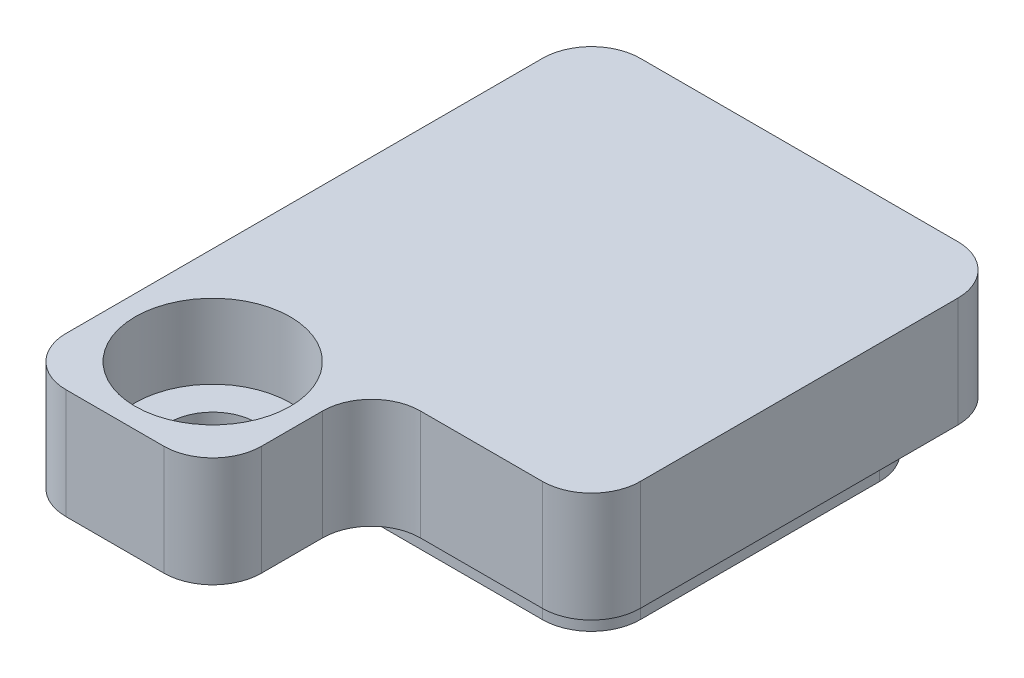
ISO-10303-21;
HEADER;
FILE_DESCRIPTION(('STEP AP214'),'2;1');
FILE_NAME('part.step','',(''),(''),'','','');
FILE_SCHEMA(('AUTOMOTIVE_DESIGN { 1 0 10303 214 1 1 1 1 }'));
ENDSEC;
DATA;
#1=APPLICATION_CONTEXT('core data for automotive mechanical design processes');
#2=APPLICATION_PROTOCOL_DEFINITION('international standard','automotive_design',2000,#1);
#3=PRODUCT_CONTEXT('',#1,'mechanical');
#4=PRODUCT('Part','Part','',(#3));
#5=PRODUCT_RELATED_PRODUCT_CATEGORY('part','',(#4));
#6=PRODUCT_DEFINITION_FORMATION('','',#4);
#7=PRODUCT_DEFINITION_CONTEXT('part definition',#1,'design');
#8=PRODUCT_DEFINITION('design','',#6,#7);
#9=PRODUCT_DEFINITION_SHAPE('','',#8);
#10=(LENGTH_UNIT() NAMED_UNIT(*) SI_UNIT(.MILLI.,.METRE.));
#11=(NAMED_UNIT(*) PLANE_ANGLE_UNIT() SI_UNIT($,.RADIAN.));
#12=(NAMED_UNIT(*) SI_UNIT($,.STERADIAN.) SOLID_ANGLE_UNIT());
#13=UNCERTAINTY_MEASURE_WITH_UNIT(LENGTH_MEASURE(1.E-05),#10,'distance_accuracy_value','');
#14=(GEOMETRIC_REPRESENTATION_CONTEXT(3) GLOBAL_UNCERTAINTY_ASSIGNED_CONTEXT((#13)) GLOBAL_UNIT_ASSIGNED_CONTEXT((#10,
#11,#12)) REPRESENTATION_CONTEXT('',''));
#15=CARTESIAN_POINT('',(0.,0.,0.));
#16=DIRECTION('',(0.,0.,1.));
#17=DIRECTION('',(1.,0.,0.));
#18=AXIS2_PLACEMENT_3D('',#15,#16,#17);
#19=CARTESIAN_POINT('',(-4.25,2.25,4.25));
#20=DIRECTION('',(0.,0.,-1.));
#21=DIRECTION('',(-1.,0.,0.));
#22=AXIS2_PLACEMENT_3D('',#19,#20,#21);
#23=PLANE('',#22);
#24=DIRECTION('',(1.,0.,0.));
#25=VECTOR('',#24,1.);
#26=CARTESIAN_POINT('',(-4.25,0.,4.25));
#27=LINE('',#26,#25);
#28=CARTESIAN_POINT('',(0.749999999999998,0.,4.25));
#29=VERTEX_POINT('',#28);
#30=CARTESIAN_POINT('',(3.25,0.,4.25));
#31=VERTEX_POINT('',#30);
#32=EDGE_CURVE('E209',#29,#31,#27,.T.);
#33=ORIENTED_EDGE('',*,*,#32,.T.);
#34=DIRECTION('',(0.,-1.,0.));
#35=VECTOR('',#34,1.);
#36=CARTESIAN_POINT('',(3.25,2.25,4.25));
#37=LINE('',#36,#35);
#38=CARTESIAN_POINT('',(3.25,2.25,4.25));
#39=VERTEX_POINT('',#38);
#40=EDGE_CURVE('E46',#31,#39,#37,.F.);
#41=ORIENTED_EDGE('',*,*,#40,.T.);
#42=DIRECTION('',(1.,0.,0.));
#43=VECTOR('',#42,1.);
#44=CARTESIAN_POINT('',(-4.25,2.25,4.25));
#45=LINE('',#44,#43);
#46=CARTESIAN_POINT('',(0.749999999999997,2.25,4.25));
#47=VERTEX_POINT('',#46);
#48=EDGE_CURVE('E215',#47,#39,#45,.T.);
#49=ORIENTED_EDGE('',*,*,#48,.F.);
#50=DIRECTION('',(0.,1.,0.));
#51=VECTOR('',#50,1.);
#52=CARTESIAN_POINT('',(0.749999999999998,0.,4.25));
#53=LINE('',#52,#51);
#54=EDGE_CURVE('E252',#47,#29,#53,.F.);
#55=ORIENTED_EDGE('',*,*,#54,.T.);
#56=EDGE_LOOP('',(#33,#41,#49,#55));
#57=FACE_BOUND('',#56,.T.);
#58=ADVANCED_FACE('F31',(#57),#23,.F.);
#59=CARTESIAN_POINT('',(4.25,0.,-4.25));
#60=DIRECTION('',(0.,-1.,0.));
#61=DIRECTION('',(0.,0.,-1.));
#62=AXIS2_PLACEMENT_3D('',#59,#60,#61);
#63=PLANE('',#62);
#64=CARTESIAN_POINT('',(-2.25,0.,5.5));
#65=DIRECTION('',(0.,-1.,0.));
#66=DIRECTION('',(0.,0.,-1.));
#67=AXIS2_PLACEMENT_3D('',#64,#65,#66);
#68=CIRCLE('',#67,0.888999999999999);
#69=CARTESIAN_POINT('',(-2.25,0.,4.611));
#70=VERTEX_POINT('',#69);
#71=EDGE_CURVE('E312',#70,#70,#68,.T.);
#72=ORIENTED_EDGE('',*,*,#71,.F.);
#73=EDGE_LOOP('',(#72));
#74=FACE_BOUND('',#73,.T.);
#75=DIRECTION('',(0.,0.,1.));
#76=VECTOR('',#75,1.);
#77=CARTESIAN_POINT('',(-4.25,0.,4.25));
#78=LINE('',#77,#76);
#79=CARTESIAN_POINT('',(-4.25,0.,-3.25));
#80=VERTEX_POINT('',#79);
#81=CARTESIAN_POINT('',(-4.25,0.,6.5));
#82=VERTEX_POINT('',#81);
#83=EDGE_CURVE('E304',#80,#82,#78,.T.);
#84=ORIENTED_EDGE('',*,*,#83,.F.);
#85=CARTESIAN_POINT('',(-3.25,0.,-3.25));
#86=DIRECTION('',(0.,-1.,0.));
#87=DIRECTION('',(0.,0.,-1.));
#88=AXIS2_PLACEMENT_3D('',#85,#86,#87);
#89=CIRCLE('',#88,1.);
#90=CARTESIAN_POINT('',(-3.25,0.,-4.25));
#91=VERTEX_POINT('',#90);
#92=EDGE_CURVE('E442',#80,#91,#89,.T.);
#93=ORIENTED_EDGE('',*,*,#92,.T.);
#94=DIRECTION('',(-1.,0.,0.));
#95=VECTOR('',#94,1.);
#96=CARTESIAN_POINT('',(-4.25,0.,-4.25));
#97=LINE('',#96,#95);
#98=CARTESIAN_POINT('',(3.25,0.,-4.25));
#99=VERTEX_POINT('',#98);
#100=EDGE_CURVE('E337',#99,#91,#97,.T.);
#101=ORIENTED_EDGE('',*,*,#100,.F.);
#102=CARTESIAN_POINT('',(3.25,0.,-3.25));
#103=DIRECTION('',(0.,-1.,0.));
#104=DIRECTION('',(0.,0.,-1.));
#105=AXIS2_PLACEMENT_3D('',#102,#103,#104);
#106=CIRCLE('',#105,1.);
#107=CARTESIAN_POINT('',(4.25,0.,-3.25));
#108=VERTEX_POINT('',#107);
#109=EDGE_CURVE('E440',#99,#108,#106,.T.);
#110=ORIENTED_EDGE('',*,*,#109,.T.);
#111=DIRECTION('',(0.,0.,-1.));
#112=VECTOR('',#111,1.);
#113=CARTESIAN_POINT('',(4.25,0.,4.25));
#114=LINE('',#113,#112);
#115=CARTESIAN_POINT('',(4.25,0.,3.25));
#116=VERTEX_POINT('',#115);
#117=EDGE_CURVE('E218',#116,#108,#114,.T.);
#118=ORIENTED_EDGE('',*,*,#117,.F.);
#119=CARTESIAN_POINT('',(3.25,0.,3.25));
#120=DIRECTION('',(0.,-1.,0.));
#121=DIRECTION('',(0.,0.,-1.));
#122=AXIS2_PLACEMENT_3D('',#119,#120,#121);
#123=CIRCLE('',#122,1.);
#124=EDGE_CURVE('E436',#116,#31,#123,.T.);
#125=ORIENTED_EDGE('',*,*,#124,.T.);
#126=ORIENTED_EDGE('',*,*,#32,.F.);
#127=CARTESIAN_POINT('',(0.749999999999998,0.,5.25));
#128=DIRECTION('',(0.,-1.,0.));
#129=DIRECTION('',(0.,0.,-1.));
#130=AXIS2_PLACEMENT_3D('',#127,#128,#129);
#131=CIRCLE('',#130,1.);
#132=CARTESIAN_POINT('',(-0.250000000000002,0.,5.25));
#133=VERTEX_POINT('',#132);
#134=EDGE_CURVE('E11',#29,#133,#131,.F.);
#135=ORIENTED_EDGE('',*,*,#134,.T.);
#136=DIRECTION('',(0.,0.,-1.));
#137=VECTOR('',#136,1.);
#138=CARTESIAN_POINT('',(-0.250000000000002,0.,7.5));
#139=LINE('',#138,#137);
#140=CARTESIAN_POINT('',(-0.250000000000002,0.,6.5));
#141=VERTEX_POINT('',#140);
#142=EDGE_CURVE('E278',#141,#133,#139,.T.);
#143=ORIENTED_EDGE('',*,*,#142,.F.);
#144=CARTESIAN_POINT('',(-1.25,0.,6.5));
#145=DIRECTION('',(0.,-1.,0.));
#146=DIRECTION('',(0.,0.,-1.));
#147=AXIS2_PLACEMENT_3D('',#144,#145,#146);
#148=CIRCLE('',#147,1.);
#149=CARTESIAN_POINT('',(-1.25,0.,7.5));
#150=VERTEX_POINT('',#149);
#151=EDGE_CURVE('E301',#141,#150,#148,.T.);
#152=ORIENTED_EDGE('',*,*,#151,.T.);
#153=DIRECTION('',(1.,0.,0.));
#154=VECTOR('',#153,1.);
#155=CARTESIAN_POINT('',(-4.25,0.,7.5));
#156=LINE('',#155,#154);
#157=CARTESIAN_POINT('',(-3.25,0.,7.5));
#158=VERTEX_POINT('',#157);
#159=EDGE_CURVE('E315',#158,#150,#156,.T.);
#160=ORIENTED_EDGE('',*,*,#159,.F.);
#161=CARTESIAN_POINT('',(-3.25,0.,6.5));
#162=DIRECTION('',(0.,-1.,0.));
#163=DIRECTION('',(0.,0.,-1.));
#164=AXIS2_PLACEMENT_3D('',#161,#162,#163);
#165=CIRCLE('',#164,1.);
#166=EDGE_CURVE('E358',#158,#82,#165,.T.);
#167=ORIENTED_EDGE('',*,*,#166,.T.);
#168=EDGE_LOOP('',(#84,#93,#101,#110,#118,#125,#126,#135,#143,#152,#160,#167));
#169=FACE_BOUND('',#168,.T.);
#170=DIRECTION('',(-1.,0.,0.));
#171=VECTOR('',#170,1.);
#172=CARTESIAN_POINT('',(-3.45,0.,3.45));
#173=LINE('',#172,#171);
#174=CARTESIAN_POINT('',(2.45,0.,3.45));
#175=VERTEX_POINT('',#174);
#176=CARTESIAN_POINT('',(-2.45,0.,3.45));
#177=VERTEX_POINT('',#176);
#178=EDGE_CURVE('E201',#175,#177,#173,.T.);
#179=ORIENTED_EDGE('',*,*,#178,.F.);
#180=CARTESIAN_POINT('',(2.45,0.,2.45));
#181=DIRECTION('',(0.,-1.,0.));
#182=DIRECTION('',(0.,0.,-1.));
#183=AXIS2_PLACEMENT_3D('',#180,#181,#182);
#184=CIRCLE('',#183,1.);
#185=CARTESIAN_POINT('',(3.45,0.,2.45));
#186=VERTEX_POINT('',#185);
#187=EDGE_CURVE('E267',#175,#186,#184,.F.);
#188=ORIENTED_EDGE('',*,*,#187,.T.);
#189=DIRECTION('',(0.,0.,1.));
#190=VECTOR('',#189,1.);
#191=CARTESIAN_POINT('',(3.45,0.,-3.45));
#192=LINE('',#191,#190);
#193=CARTESIAN_POINT('',(3.45,0.,-2.45));
#194=VERTEX_POINT('',#193);
#195=EDGE_CURVE('E269',#194,#186,#192,.T.);
#196=ORIENTED_EDGE('',*,*,#195,.F.);
#197=CARTESIAN_POINT('',(2.45,0.,-2.45));
#198=DIRECTION('',(0.,-1.,0.));
#199=DIRECTION('',(0.,0.,-1.));
#200=AXIS2_PLACEMENT_3D('',#197,#198,#199);
#201=CIRCLE('',#200,1.);
#202=CARTESIAN_POINT('',(2.45,0.,-3.45));
#203=VERTEX_POINT('',#202);
#204=EDGE_CURVE('E194',#194,#203,#201,.F.);
#205=ORIENTED_EDGE('',*,*,#204,.T.);
#206=DIRECTION('',(1.,0.,0.));
#207=VECTOR('',#206,1.);
#208=CARTESIAN_POINT('',(-3.45,0.,-3.45));
#209=LINE('',#208,#207);
#210=CARTESIAN_POINT('',(-2.45,0.,-3.45));
#211=VERTEX_POINT('',#210);
#212=EDGE_CURVE('E184',#211,#203,#209,.T.);
#213=ORIENTED_EDGE('',*,*,#212,.F.);
#214=CARTESIAN_POINT('',(-2.45,0.,-2.45));
#215=DIRECTION('',(0.,-1.,0.));
#216=DIRECTION('',(0.,0.,-1.));
#217=AXIS2_PLACEMENT_3D('',#214,#215,#216);
#218=CIRCLE('',#217,1.);
#219=CARTESIAN_POINT('',(-3.45,0.,-2.45));
#220=VERTEX_POINT('',#219);
#221=EDGE_CURVE('E167',#211,#220,#218,.F.);
#222=ORIENTED_EDGE('',*,*,#221,.T.);
#223=DIRECTION('',(0.,0.,-1.));
#224=VECTOR('',#223,1.);
#225=CARTESIAN_POINT('',(-3.45,0.,-3.45));
#226=LINE('',#225,#224);
#227=CARTESIAN_POINT('',(-3.45,0.,2.45));
#228=VERTEX_POINT('',#227);
#229=EDGE_CURVE('E196',#228,#220,#226,.T.);
#230=ORIENTED_EDGE('',*,*,#229,.F.);
#231=CARTESIAN_POINT('',(-2.45,0.,2.45));
#232=DIRECTION('',(0.,-1.,0.));
#233=DIRECTION('',(0.,0.,-1.));
#234=AXIS2_PLACEMENT_3D('',#231,#232,#233);
#235=CIRCLE('',#234,1.);
#236=EDGE_CURVE('E177',#228,#177,#235,.F.);
#237=ORIENTED_EDGE('',*,*,#236,.T.);
#238=EDGE_LOOP('',(#179,#188,#196,#205,#213,#222,#230,#237));
#239=FACE_BOUND('',#238,.T.);
#240=ADVANCED_FACE('F192',(#74,#169,#239),#63,.T.);
#241=CARTESIAN_POINT('',(4.25,2.25,4.25));
#242=DIRECTION('',(-1.,0.,0.));
#243=DIRECTION('',(0.,0.,1.));
#244=AXIS2_PLACEMENT_3D('',#241,#242,#243);
#245=PLANE('',#244);
#246=ORIENTED_EDGE('',*,*,#117,.T.);
#247=DIRECTION('',(0.,-1.,0.));
#248=VECTOR('',#247,1.);
#249=CARTESIAN_POINT('',(4.25,2.25,-3.25));
#250=LINE('',#249,#248);
#251=CARTESIAN_POINT('',(4.25,2.25,-3.25));
#252=VERTEX_POINT('',#251);
#253=EDGE_CURVE('E250',#108,#252,#250,.F.);
#254=ORIENTED_EDGE('',*,*,#253,.T.);
#255=DIRECTION('',(0.,0.,-1.));
#256=VECTOR('',#255,1.);
#257=CARTESIAN_POINT('',(4.25,2.25,4.25));
#258=LINE('',#257,#256);
#259=CARTESIAN_POINT('',(4.25,2.25,3.25));
#260=VERTEX_POINT('',#259);
#261=EDGE_CURVE('E205',#260,#252,#258,.T.);
#262=ORIENTED_EDGE('',*,*,#261,.F.);
#263=DIRECTION('',(0.,-1.,0.));
#264=VECTOR('',#263,1.);
#265=CARTESIAN_POINT('',(4.25,2.25,3.25));
#266=LINE('',#265,#264);
#267=EDGE_CURVE('E247',#260,#116,#266,.T.);
#268=ORIENTED_EDGE('',*,*,#267,.T.);
#269=EDGE_LOOP('',(#246,#254,#262,#268));
#270=FACE_BOUND('',#269,.T.);
#271=ADVANCED_FACE('F396',(#270),#245,.F.);
#272=CARTESIAN_POINT('',(-4.25,2.25,-4.25));
#273=DIRECTION('',(0.,0.,1.));
#274=DIRECTION('',(1.,0.,0.));
#275=AXIS2_PLACEMENT_3D('',#272,#273,#274);
#276=PLANE('',#275);
#277=ORIENTED_EDGE('',*,*,#100,.T.);
#278=DIRECTION('',(0.,-1.,0.));
#279=VECTOR('',#278,1.);
#280=CARTESIAN_POINT('',(-3.25,2.25,-4.25));
#281=LINE('',#280,#279);
#282=CARTESIAN_POINT('',(-3.25,2.25,-4.25));
#283=VERTEX_POINT('',#282);
#284=EDGE_CURVE('E229',#91,#283,#281,.F.);
#285=ORIENTED_EDGE('',*,*,#284,.T.);
#286=DIRECTION('',(-1.,0.,0.));
#287=VECTOR('',#286,1.);
#288=CARTESIAN_POINT('',(-4.25,2.25,-4.25));
#289=LINE('',#288,#287);
#290=CARTESIAN_POINT('',(3.25,2.25,-4.25));
#291=VERTEX_POINT('',#290);
#292=EDGE_CURVE('E208',#291,#283,#289,.T.);
#293=ORIENTED_EDGE('',*,*,#292,.F.);
#294=DIRECTION('',(0.,-1.,0.));
#295=VECTOR('',#294,1.);
#296=CARTESIAN_POINT('',(3.25,2.25,-4.25));
#297=LINE('',#296,#295);
#298=EDGE_CURVE('E444',#291,#99,#297,.T.);
#299=ORIENTED_EDGE('',*,*,#298,.T.);
#300=EDGE_LOOP('',(#277,#285,#293,#299));
#301=FACE_BOUND('',#300,.T.);
#302=ADVANCED_FACE('F388',(#301),#276,.F.);
#303=CARTESIAN_POINT('',(-4.25,2.25,4.25));
#304=DIRECTION('',(1.,0.,0.));
#305=DIRECTION('',(0.,0.,-1.));
#306=AXIS2_PLACEMENT_3D('',#303,#304,#305);
#307=PLANE('',#306);
#308=DIRECTION('',(0.,0.,1.));
#309=VECTOR('',#308,1.);
#310=CARTESIAN_POINT('',(-4.25,2.25,4.25));
#311=LINE('',#310,#309);
#312=CARTESIAN_POINT('',(-4.25,2.25,-3.25));
#313=VERTEX_POINT('',#312);
#314=CARTESIAN_POINT('',(-4.25,2.25,6.5));
#315=VERTEX_POINT('',#314);
#316=EDGE_CURVE('E212',#313,#315,#311,.T.);
#317=ORIENTED_EDGE('',*,*,#316,.F.);
#318=DIRECTION('',(0.,-1.,0.));
#319=VECTOR('',#318,1.);
#320=CARTESIAN_POINT('',(-4.25,2.25,-3.25));
#321=LINE('',#320,#319);
#322=EDGE_CURVE('E298',#313,#80,#321,.T.);
#323=ORIENTED_EDGE('',*,*,#322,.T.);
#324=ORIENTED_EDGE('',*,*,#83,.T.);
#325=DIRECTION('',(0.,-1.,0.));
#326=VECTOR('',#325,1.);
#327=CARTESIAN_POINT('',(-4.25,2.25,6.5));
#328=LINE('',#327,#326);
#329=EDGE_CURVE('E296',#82,#315,#328,.F.);
#330=ORIENTED_EDGE('',*,*,#329,.T.);
#331=EDGE_LOOP('',(#317,#323,#324,#330));
#332=FACE_BOUND('',#331,.T.);
#333=ADVANCED_FACE('F351',(#332),#307,.F.);
#334=CARTESIAN_POINT('',(4.25,2.25,-4.25));
#335=DIRECTION('',(0.,-1.,0.));
#336=DIRECTION('',(0.,0.,-1.));
#337=AXIS2_PLACEMENT_3D('',#334,#335,#336);
#338=PLANE('',#337);
#339=CARTESIAN_POINT('',(-2.25,2.25,5.5));
#340=DIRECTION('',(0.,1.,0.));
#341=DIRECTION('',(0.,0.,1.));
#342=AXIS2_PLACEMENT_3D('',#339,#340,#341);
#343=CIRCLE('',#342,1.5875);
#344=CARTESIAN_POINT('',(-2.25,2.25,7.0875));
#345=VERTEX_POINT('',#344);
#346=EDGE_CURVE('E375',#345,#345,#343,.T.);
#347=ORIENTED_EDGE('',*,*,#346,.F.);
#348=EDGE_LOOP('',(#347));
#349=FACE_BOUND('',#348,.T.);
#350=ORIENTED_EDGE('',*,*,#292,.T.);
#351=CARTESIAN_POINT('',(-3.25,2.25,-3.25));
#352=DIRECTION('',(0.,-1.,0.));
#353=DIRECTION('',(0.,0.,-1.));
#354=AXIS2_PLACEMENT_3D('',#351,#352,#353);
#355=CIRCLE('',#354,1.);
#356=EDGE_CURVE('E235',#283,#313,#355,.F.);
#357=ORIENTED_EDGE('',*,*,#356,.T.);
#358=ORIENTED_EDGE('',*,*,#316,.T.);
#359=CARTESIAN_POINT('',(-3.25,2.25,6.5));
#360=DIRECTION('',(0.,-1.,0.));
#361=DIRECTION('',(0.,0.,-1.));
#362=AXIS2_PLACEMENT_3D('',#359,#360,#361);
#363=CIRCLE('',#362,1.);
#364=CARTESIAN_POINT('',(-3.25,2.25,7.5));
#365=VERTEX_POINT('',#364);
#366=EDGE_CURVE('E228',#315,#365,#363,.F.);
#367=ORIENTED_EDGE('',*,*,#366,.T.);
#368=DIRECTION('',(-1.,0.,0.));
#369=VECTOR('',#368,1.);
#370=CARTESIAN_POINT('',(-4.25,2.25,7.5));
#371=LINE('',#370,#369);
#372=CARTESIAN_POINT('',(-1.25,2.25,7.5));
#373=VERTEX_POINT('',#372);
#374=EDGE_CURVE('E362',#373,#365,#371,.T.);
#375=ORIENTED_EDGE('',*,*,#374,.F.);
#376=CARTESIAN_POINT('',(-1.25,2.25,6.5));
#377=DIRECTION('',(0.,-1.,0.));
#378=DIRECTION('',(0.,0.,-1.));
#379=AXIS2_PLACEMENT_3D('',#376,#377,#378);
#380=CIRCLE('',#379,1.);
#381=CARTESIAN_POINT('',(-0.250000000000002,2.25,6.5));
#382=VERTEX_POINT('',#381);
#383=EDGE_CURVE('E226',#373,#382,#380,.F.);
#384=ORIENTED_EDGE('',*,*,#383,.T.);
#385=DIRECTION('',(0.,0.,-1.));
#386=VECTOR('',#385,1.);
#387=CARTESIAN_POINT('',(-0.250000000000002,2.25,7.5));
#388=LINE('',#387,#386);
#389=CARTESIAN_POINT('',(-0.250000000000002,2.25,5.25));
#390=VERTEX_POINT('',#389);
#391=EDGE_CURVE('E223',#382,#390,#388,.T.);
#392=ORIENTED_EDGE('',*,*,#391,.T.);
#393=CARTESIAN_POINT('',(0.749999999999998,2.25,5.25));
#394=DIRECTION('',(0.,-1.,0.));
#395=DIRECTION('',(0.,0.,-1.));
#396=AXIS2_PLACEMENT_3D('',#393,#394,#395);
#397=CIRCLE('',#396,1.);
#398=EDGE_CURVE('E39',#390,#47,#397,.T.);
#399=ORIENTED_EDGE('',*,*,#398,.T.);
#400=ORIENTED_EDGE('',*,*,#48,.T.);
#401=CARTESIAN_POINT('',(3.25,2.25,3.25));
#402=DIRECTION('',(0.,-1.,0.));
#403=DIRECTION('',(0.,0.,-1.));
#404=AXIS2_PLACEMENT_3D('',#401,#402,#403);
#405=CIRCLE('',#404,1.);
#406=EDGE_CURVE('E231',#39,#260,#405,.F.);
#407=ORIENTED_EDGE('',*,*,#406,.T.);
#408=ORIENTED_EDGE('',*,*,#261,.T.);
#409=CARTESIAN_POINT('',(3.25,2.25,-3.25));
#410=DIRECTION('',(0.,-1.,0.));
#411=DIRECTION('',(0.,0.,-1.));
#412=AXIS2_PLACEMENT_3D('',#409,#410,#411);
#413=CIRCLE('',#412,1.);
#414=EDGE_CURVE('E233',#252,#291,#413,.F.);
#415=ORIENTED_EDGE('',*,*,#414,.T.);
#416=EDGE_LOOP('',(#350,#357,#358,#367,#375,#384,#392,#399,#400,#407,#408,#415));
#417=FACE_BOUND('',#416,.T.);
#418=ADVANCED_FACE('F361',(#349,#417),#338,.F.);
#419=CARTESIAN_POINT('',(3.45,-1.,-3.45));
#420=DIRECTION('',(-1.,0.,0.));
#421=DIRECTION('',(0.,0.,1.));
#422=AXIS2_PLACEMENT_3D('',#419,#420,#421);
#423=PLANE('',#422);
#424=DIRECTION('',(0.,0.,1.));
#425=VECTOR('',#424,1.);
#426=CARTESIAN_POINT('',(3.45,-1.,-3.45));
#427=LINE('',#426,#425);
#428=CARTESIAN_POINT('',(3.45,-1.,-2.45));
#429=VERTEX_POINT('',#428);
#430=CARTESIAN_POINT('',(3.45,-1.,2.45));
#431=VERTEX_POINT('',#430);
#432=EDGE_CURVE('E195',#429,#431,#427,.T.);
#433=ORIENTED_EDGE('',*,*,#432,.F.);
#434=DIRECTION('',(0.,1.,0.));
#435=VECTOR('',#434,1.);
#436=CARTESIAN_POINT('',(3.45,-1.,-2.45));
#437=LINE('',#436,#435);
#438=EDGE_CURVE('E244',#429,#194,#437,.T.);
#439=ORIENTED_EDGE('',*,*,#438,.T.);
#440=ORIENTED_EDGE('',*,*,#195,.T.);
#441=DIRECTION('',(0.,1.,0.));
#442=VECTOR('',#441,1.);
#443=CARTESIAN_POINT('',(3.45,-1.,2.45));
#444=LINE('',#443,#442);
#445=EDGE_CURVE('E242',#186,#431,#444,.F.);
#446=ORIENTED_EDGE('',*,*,#445,.T.);
#447=EDGE_LOOP('',(#433,#439,#440,#446));
#448=FACE_BOUND('',#447,.T.);
#449=ADVANCED_FACE('F276',(#448),#423,.F.);
#450=CARTESIAN_POINT('',(-3.45,-1.,3.45));
#451=DIRECTION('',(0.,0.,-1.));
#452=DIRECTION('',(-1.,0.,0.));
#453=AXIS2_PLACEMENT_3D('',#450,#451,#452);
#454=PLANE('',#453);
#455=ORIENTED_EDGE('',*,*,#178,.T.);
#456=DIRECTION('',(0.,1.,0.));
#457=VECTOR('',#456,1.);
#458=CARTESIAN_POINT('',(-2.45,-1.,3.45));
#459=LINE('',#458,#457);
#460=CARTESIAN_POINT('',(-2.45,-1.,3.45));
#461=VERTEX_POINT('',#460);
#462=EDGE_CURVE('E240',#177,#461,#459,.F.);
#463=ORIENTED_EDGE('',*,*,#462,.T.);
#464=DIRECTION('',(-1.,0.,0.));
#465=VECTOR('',#464,1.);
#466=CARTESIAN_POINT('',(-3.45,-1.,3.45));
#467=LINE('',#466,#465);
#468=CARTESIAN_POINT('',(2.45,-1.,3.45));
#469=VERTEX_POINT('',#468);
#470=EDGE_CURVE('E199',#469,#461,#467,.T.);
#471=ORIENTED_EDGE('',*,*,#470,.F.);
#472=DIRECTION('',(0.,1.,0.));
#473=VECTOR('',#472,1.);
#474=CARTESIAN_POINT('',(2.45,-1.,3.45));
#475=LINE('',#474,#473);
#476=EDGE_CURVE('E237',#469,#175,#475,.T.);
#477=ORIENTED_EDGE('',*,*,#476,.T.);
#478=EDGE_LOOP('',(#455,#463,#471,#477));
#479=FACE_BOUND('',#478,.T.);
#480=ADVANCED_FACE('F328',(#479),#454,.F.);
#481=CARTESIAN_POINT('',(-3.45,-1.,-3.45));
#482=DIRECTION('',(1.,0.,0.));
#483=DIRECTION('',(0.,0.,-1.));
#484=AXIS2_PLACEMENT_3D('',#481,#482,#483);
#485=PLANE('',#484);
#486=ORIENTED_EDGE('',*,*,#229,.T.);
#487=DIRECTION('',(0.,1.,0.));
#488=VECTOR('',#487,1.);
#489=CARTESIAN_POINT('',(-3.45,-1.,-2.45));
#490=LINE('',#489,#488);
#491=CARTESIAN_POINT('',(-3.45,-1.,-2.45));
#492=VERTEX_POINT('',#491);
#493=EDGE_CURVE('E172',#220,#492,#490,.F.);
#494=ORIENTED_EDGE('',*,*,#493,.T.);
#495=DIRECTION('',(0.,0.,-1.));
#496=VECTOR('',#495,1.);
#497=CARTESIAN_POINT('',(-3.45,-1.,-3.45));
#498=LINE('',#497,#496);
#499=CARTESIAN_POINT('',(-3.45,-1.,2.45));
#500=VERTEX_POINT('',#499);
#501=EDGE_CURVE('E323',#500,#492,#498,.T.);
#502=ORIENTED_EDGE('',*,*,#501,.F.);
#503=DIRECTION('',(0.,1.,0.));
#504=VECTOR('',#503,1.);
#505=CARTESIAN_POINT('',(-3.45,-1.,2.45));
#506=LINE('',#505,#504);
#507=EDGE_CURVE('E188',#500,#228,#506,.T.);
#508=ORIENTED_EDGE('',*,*,#507,.T.);
#509=EDGE_LOOP('',(#486,#494,#502,#508));
#510=FACE_BOUND('',#509,.T.);
#511=ADVANCED_FACE('F321',(#510),#485,.F.);
#512=CARTESIAN_POINT('',(-3.45,-1.,-3.45));
#513=DIRECTION('',(0.,0.,1.));
#514=DIRECTION('',(1.,0.,0.));
#515=AXIS2_PLACEMENT_3D('',#512,#513,#514);
#516=PLANE('',#515);
#517=DIRECTION('',(1.,0.,0.));
#518=VECTOR('',#517,1.);
#519=CARTESIAN_POINT('',(-3.45,-1.,-3.45));
#520=LINE('',#519,#518);
#521=CARTESIAN_POINT('',(-2.45,-1.,-3.45));
#522=VERTEX_POINT('',#521);
#523=CARTESIAN_POINT('',(2.45,-1.,-3.45));
#524=VERTEX_POINT('',#523);
#525=EDGE_CURVE('E187',#522,#524,#520,.T.);
#526=ORIENTED_EDGE('',*,*,#525,.F.);
#527=DIRECTION('',(0.,1.,0.));
#528=VECTOR('',#527,1.);
#529=CARTESIAN_POINT('',(-2.45,-1.,-3.45));
#530=LINE('',#529,#528);
#531=EDGE_CURVE('E171',#522,#211,#530,.T.);
#532=ORIENTED_EDGE('',*,*,#531,.T.);
#533=ORIENTED_EDGE('',*,*,#212,.T.);
#534=DIRECTION('',(0.,1.,0.));
#535=VECTOR('',#534,1.);
#536=CARTESIAN_POINT('',(2.45,-1.,-3.45));
#537=LINE('',#536,#535);
#538=EDGE_CURVE('E189',#203,#524,#537,.F.);
#539=ORIENTED_EDGE('',*,*,#538,.T.);
#540=EDGE_LOOP('',(#526,#532,#533,#539));
#541=FACE_BOUND('',#540,.T.);
#542=ADVANCED_FACE('F183',(#541),#516,.F.);
#543=CARTESIAN_POINT('',(3.45,-1.,3.45));
#544=DIRECTION('',(0.,1.,0.));
#545=DIRECTION('',(0.,0.,1.));
#546=AXIS2_PLACEMENT_3D('',#543,#544,#545);
#547=PLANE('',#546);
#548=ORIENTED_EDGE('',*,*,#501,.T.);
#549=CARTESIAN_POINT('',(-2.45,-1.,-2.45));
#550=DIRECTION('',(0.,1.,0.));
#551=DIRECTION('',(0.,0.,1.));
#552=AXIS2_PLACEMENT_3D('',#549,#550,#551);
#553=CIRCLE('',#552,1.);
#554=EDGE_CURVE('E294',#492,#522,#553,.F.);
#555=ORIENTED_EDGE('',*,*,#554,.T.);
#556=ORIENTED_EDGE('',*,*,#525,.T.);
#557=CARTESIAN_POINT('',(2.45,-1.,-2.45));
#558=DIRECTION('',(0.,1.,0.));
#559=DIRECTION('',(0.,0.,1.));
#560=AXIS2_PLACEMENT_3D('',#557,#558,#559);
#561=CIRCLE('',#560,1.);
#562=EDGE_CURVE('E286',#524,#429,#561,.F.);
#563=ORIENTED_EDGE('',*,*,#562,.T.);
#564=ORIENTED_EDGE('',*,*,#432,.T.);
#565=CARTESIAN_POINT('',(2.45,-1.,2.45));
#566=DIRECTION('',(0.,1.,0.));
#567=DIRECTION('',(0.,0.,1.));
#568=AXIS2_PLACEMENT_3D('',#565,#566,#567);
#569=CIRCLE('',#568,1.);
#570=EDGE_CURVE('E282',#431,#469,#569,.F.);
#571=ORIENTED_EDGE('',*,*,#570,.T.);
#572=ORIENTED_EDGE('',*,*,#470,.T.);
#573=CARTESIAN_POINT('',(-2.45,-1.,2.45));
#574=DIRECTION('',(0.,1.,0.));
#575=DIRECTION('',(0.,0.,1.));
#576=AXIS2_PLACEMENT_3D('',#573,#574,#575);
#577=CIRCLE('',#576,1.);
#578=EDGE_CURVE('E288',#461,#500,#577,.F.);
#579=ORIENTED_EDGE('',*,*,#578,.T.);
#580=EDGE_LOOP('',(#548,#555,#556,#563,#564,#571,#572,#579));
#581=FACE_BOUND('',#580,.T.);
#582=ADVANCED_FACE('F330',(#581),#547,.F.);
#583=CARTESIAN_POINT('',(-0.250000000000002,2.25,7.5));
#584=DIRECTION('',(-1.,0.,0.));
#585=DIRECTION('',(0.,-1.,0.));
#586=AXIS2_PLACEMENT_3D('',#583,#584,#585);
#587=PLANE('',#586);
#588=ORIENTED_EDGE('',*,*,#391,.F.);
#589=DIRECTION('',(0.,1.,0.));
#590=VECTOR('',#589,1.);
#591=CARTESIAN_POINT('',(-0.250000000000002,0.,6.5));
#592=LINE('',#591,#590);
#593=EDGE_CURVE('E178',#382,#141,#592,.F.);
#594=ORIENTED_EDGE('',*,*,#593,.T.);
#595=ORIENTED_EDGE('',*,*,#142,.T.);
#596=DIRECTION('',(0.,1.,0.));
#597=VECTOR('',#596,1.);
#598=CARTESIAN_POINT('',(-0.250000000000002,2.25,5.25));
#599=LINE('',#598,#597);
#600=EDGE_CURVE('E261',#133,#390,#599,.T.);
#601=ORIENTED_EDGE('',*,*,#600,.T.);
#602=EDGE_LOOP('',(#588,#594,#595,#601));
#603=FACE_BOUND('',#602,.T.);
#604=ADVANCED_FACE('F459',(#603),#587,.F.);
#605=CARTESIAN_POINT('',(-4.25,0.,7.5));
#606=DIRECTION('',(0.,0.,1.));
#607=DIRECTION('',(1.,0.,0.));
#608=AXIS2_PLACEMENT_3D('',#605,#606,#607);
#609=PLANE('',#608);
#610=ORIENTED_EDGE('',*,*,#374,.T.);
#611=DIRECTION('',(0.,-1.,0.));
#612=VECTOR('',#611,1.);
#613=CARTESIAN_POINT('',(-3.25,0.,7.5));
#614=LINE('',#613,#612);
#615=EDGE_CURVE('E258',#365,#158,#614,.T.);
#616=ORIENTED_EDGE('',*,*,#615,.T.);
#617=ORIENTED_EDGE('',*,*,#159,.T.);
#618=DIRECTION('',(0.,1.,0.));
#619=VECTOR('',#618,1.);
#620=CARTESIAN_POINT('',(-1.25,2.25,7.5));
#621=LINE('',#620,#619);
#622=EDGE_CURVE('E255',#150,#373,#621,.T.);
#623=ORIENTED_EDGE('',*,*,#622,.T.);
#624=EDGE_LOOP('',(#610,#616,#617,#623));
#625=FACE_BOUND('',#624,.T.);
#626=ADVANCED_FACE('F364',(#625),#609,.T.);
#627=CARTESIAN_POINT('',(-2.25,2.25,5.5));
#628=DIRECTION('',(0.,1.,0.));
#629=DIRECTION('',(0.,0.,1.));
#630=AXIS2_PLACEMENT_3D('',#627,#628,#629);
#631=CYLINDRICAL_SURFACE('',#630,0.888999999999999);
#632=ORIENTED_EDGE('',*,*,#71,.T.);
#633=EDGE_LOOP('',(#632));
#634=FACE_BOUND('',#633,.T.);
#635=CARTESIAN_POINT('',(-2.25,0.726,5.5));
#636=DIRECTION('',(0.,1.,0.));
#637=DIRECTION('',(0.,0.,1.));
#638=AXIS2_PLACEMENT_3D('',#635,#636,#637);
#639=CIRCLE('',#638,0.889);
#640=CARTESIAN_POINT('',(-2.25,0.726,6.389));
#641=VERTEX_POINT('',#640);
#642=EDGE_CURVE('E316',#641,#641,#639,.T.);
#643=ORIENTED_EDGE('',*,*,#642,.T.);
#644=EDGE_LOOP('',(#643));
#645=FACE_BOUND('',#644,.T.);
#646=ADVANCED_FACE('F466',(#634,#645),#631,.F.);
#647=CARTESIAN_POINT('',(-1.361,0.726,5.5));
#648=DIRECTION('',(0.,-1.,0.));
#649=DIRECTION('',(0.,0.,-1.));
#650=AXIS2_PLACEMENT_3D('',#647,#648,#649);
#651=PLANE('',#650);
#652=ORIENTED_EDGE('',*,*,#642,.F.);
#653=EDGE_LOOP('',(#652));
#654=FACE_BOUND('',#653,.T.);
#655=CARTESIAN_POINT('',(-2.25,0.726,5.5));
#656=DIRECTION('',(0.,1.,0.));
#657=DIRECTION('',(0.,0.,1.));
#658=AXIS2_PLACEMENT_3D('',#655,#656,#657);
#659=CIRCLE('',#658,1.5875);
#660=CARTESIAN_POINT('',(-2.25,0.726,7.0875));
#661=VERTEX_POINT('',#660);
#662=EDGE_CURVE('E372',#661,#661,#659,.T.);
#663=ORIENTED_EDGE('',*,*,#662,.T.);
#664=EDGE_LOOP('',(#663));
#665=FACE_BOUND('',#664,.T.);
#666=ADVANCED_FACE('F573',(#654,#665),#651,.F.);
#667=CARTESIAN_POINT('',(-2.25,2.25,5.5));
#668=DIRECTION('',(0.,1.,0.));
#669=DIRECTION('',(0.,0.,1.));
#670=AXIS2_PLACEMENT_3D('',#667,#668,#669);
#671=CYLINDRICAL_SURFACE('',#670,1.5875);
#672=ORIENTED_EDGE('',*,*,#662,.F.);
#673=EDGE_LOOP('',(#672));
#674=FACE_BOUND('',#673,.T.);
#675=ORIENTED_EDGE('',*,*,#346,.T.);
#676=EDGE_LOOP('',(#675));
#677=FACE_BOUND('',#676,.T.);
#678=ADVANCED_FACE('F379',(#674,#677),#671,.F.);
#679=CARTESIAN_POINT('',(-2.45,-1.,-2.45));
#680=DIRECTION('',(0.,1.,0.));
#681=DIRECTION('',(0.,0.,1.));
#682=AXIS2_PLACEMENT_3D('',#679,#680,#681);
#683=CYLINDRICAL_SURFACE('',#682,1.);
#684=ORIENTED_EDGE('',*,*,#554,.F.);
#685=ORIENTED_EDGE('',*,*,#493,.F.);
#686=ORIENTED_EDGE('',*,*,#221,.F.);
#687=ORIENTED_EDGE('',*,*,#531,.F.);
#688=EDGE_LOOP('',(#684,#685,#686,#687));
#689=FACE_BOUND('',#688,.T.);
#690=ADVANCED_FACE('F170',(#689),#683,.T.);
#691=CARTESIAN_POINT('',(-3.25,2.25,-3.25));
#692=DIRECTION('',(0.,-1.,0.));
#693=DIRECTION('',(0.,0.,-1.));
#694=AXIS2_PLACEMENT_3D('',#691,#692,#693);
#695=CYLINDRICAL_SURFACE('',#694,1.);
#696=ORIENTED_EDGE('',*,*,#356,.F.);
#697=ORIENTED_EDGE('',*,*,#284,.F.);
#698=ORIENTED_EDGE('',*,*,#92,.F.);
#699=ORIENTED_EDGE('',*,*,#322,.F.);
#700=EDGE_LOOP('',(#696,#697,#698,#699));
#701=FACE_BOUND('',#700,.T.);
#702=ADVANCED_FACE('F405',(#701),#695,.T.);
#703=CARTESIAN_POINT('',(-2.45,-1.,2.45));
#704=DIRECTION('',(0.,1.,0.));
#705=DIRECTION('',(0.,0.,1.));
#706=AXIS2_PLACEMENT_3D('',#703,#704,#705);
#707=CYLINDRICAL_SURFACE('',#706,1.);
#708=ORIENTED_EDGE('',*,*,#578,.F.);
#709=ORIENTED_EDGE('',*,*,#462,.F.);
#710=ORIENTED_EDGE('',*,*,#236,.F.);
#711=ORIENTED_EDGE('',*,*,#507,.F.);
#712=EDGE_LOOP('',(#708,#709,#710,#711));
#713=FACE_BOUND('',#712,.T.);
#714=ADVANCED_FACE('F329',(#713),#707,.T.);
#715=CARTESIAN_POINT('',(2.45,-1.,-2.45));
#716=DIRECTION('',(0.,1.,0.));
#717=DIRECTION('',(0.,0.,1.));
#718=AXIS2_PLACEMENT_3D('',#715,#716,#717);
#719=CYLINDRICAL_SURFACE('',#718,1.);
#720=ORIENTED_EDGE('',*,*,#562,.F.);
#721=ORIENTED_EDGE('',*,*,#538,.F.);
#722=ORIENTED_EDGE('',*,*,#204,.F.);
#723=ORIENTED_EDGE('',*,*,#438,.F.);
#724=EDGE_LOOP('',(#720,#721,#722,#723));
#725=FACE_BOUND('',#724,.T.);
#726=ADVANCED_FACE('F411',(#725),#719,.T.);
#727=CARTESIAN_POINT('',(2.45,-1.,2.45));
#728=DIRECTION('',(0.,1.,0.));
#729=DIRECTION('',(0.,0.,1.));
#730=AXIS2_PLACEMENT_3D('',#727,#728,#729);
#731=CYLINDRICAL_SURFACE('',#730,1.);
#732=ORIENTED_EDGE('',*,*,#570,.F.);
#733=ORIENTED_EDGE('',*,*,#445,.F.);
#734=ORIENTED_EDGE('',*,*,#187,.F.);
#735=ORIENTED_EDGE('',*,*,#476,.F.);
#736=EDGE_LOOP('',(#732,#733,#734,#735));
#737=FACE_BOUND('',#736,.T.);
#738=ADVANCED_FACE('F281',(#737),#731,.T.);
#739=CARTESIAN_POINT('',(3.25,2.25,-3.25));
#740=DIRECTION('',(0.,-1.,0.));
#741=DIRECTION('',(0.,0.,-1.));
#742=AXIS2_PLACEMENT_3D('',#739,#740,#741);
#743=CYLINDRICAL_SURFACE('',#742,1.);
#744=ORIENTED_EDGE('',*,*,#414,.F.);
#745=ORIENTED_EDGE('',*,*,#253,.F.);
#746=ORIENTED_EDGE('',*,*,#109,.F.);
#747=ORIENTED_EDGE('',*,*,#298,.F.);
#748=EDGE_LOOP('',(#744,#745,#746,#747));
#749=FACE_BOUND('',#748,.T.);
#750=ADVANCED_FACE('F417',(#749),#743,.T.);
#751=CARTESIAN_POINT('',(3.25,2.25,3.25));
#752=DIRECTION('',(0.,-1.,0.));
#753=DIRECTION('',(0.,0.,-1.));
#754=AXIS2_PLACEMENT_3D('',#751,#752,#753);
#755=CYLINDRICAL_SURFACE('',#754,1.);
#756=ORIENTED_EDGE('',*,*,#406,.F.);
#757=ORIENTED_EDGE('',*,*,#40,.F.);
#758=ORIENTED_EDGE('',*,*,#124,.F.);
#759=ORIENTED_EDGE('',*,*,#267,.F.);
#760=EDGE_LOOP('',(#756,#757,#758,#759));
#761=FACE_BOUND('',#760,.T.);
#762=ADVANCED_FACE('F420',(#761),#755,.T.);
#763=CARTESIAN_POINT('',(-3.25,0.,6.5));
#764=DIRECTION('',(0.,1.,0.));
#765=DIRECTION('',(0.,0.,1.));
#766=AXIS2_PLACEMENT_3D('',#763,#764,#765);
#767=CYLINDRICAL_SURFACE('',#766,1.);
#768=ORIENTED_EDGE('',*,*,#366,.F.);
#769=ORIENTED_EDGE('',*,*,#329,.F.);
#770=ORIENTED_EDGE('',*,*,#166,.F.);
#771=ORIENTED_EDGE('',*,*,#615,.F.);
#772=EDGE_LOOP('',(#768,#769,#770,#771));
#773=FACE_BOUND('',#772,.T.);
#774=ADVANCED_FACE('F356',(#773),#767,.T.);
#775=CARTESIAN_POINT('',(-1.25,0.,6.5));
#776=DIRECTION('',(0.,-1.,0.));
#777=DIRECTION('',(1.,0.,0.));
#778=AXIS2_PLACEMENT_3D('',#775,#776,#777);
#779=CYLINDRICAL_SURFACE('',#778,1.);
#780=ORIENTED_EDGE('',*,*,#151,.F.);
#781=ORIENTED_EDGE('',*,*,#593,.F.);
#782=ORIENTED_EDGE('',*,*,#383,.F.);
#783=ORIENTED_EDGE('',*,*,#622,.F.);
#784=EDGE_LOOP('',(#780,#781,#782,#783));
#785=FACE_BOUND('',#784,.T.);
#786=ADVANCED_FACE('F426',(#785),#779,.T.);
#787=CARTESIAN_POINT('',(0.749999999999998,2.25,5.25));
#788=DIRECTION('',(0.,-1.,0.));
#789=DIRECTION('',(1.,0.,0.));
#790=AXIS2_PLACEMENT_3D('',#787,#788,#789);
#791=CYLINDRICAL_SURFACE('',#790,1.);
#792=ORIENTED_EDGE('',*,*,#134,.F.);
#793=ORIENTED_EDGE('',*,*,#54,.F.);
#794=ORIENTED_EDGE('',*,*,#398,.F.);
#795=ORIENTED_EDGE('',*,*,#600,.F.);
#796=EDGE_LOOP('',(#792,#793,#794,#795));
#797=FACE_BOUND('',#796,.T.);
#798=ADVANCED_FACE('F33',(#797),#791,.F.);
#799=CLOSED_SHELL('',(#58,#240,#271,#302,#333,#418,#449,#480,#511,#542,#582,#604,#626,#646,#666,
#678,#690,#702,#714,#726,#738,#750,#762,#774,#786,#798));
#800=MANIFOLD_SOLID_BREP('B2',#799);
#801=ADVANCED_BREP_SHAPE_REPRESENTATION('',(#18,#800),#14);
#802=SHAPE_DEFINITION_REPRESENTATION(#9,#801);
ENDSEC;
END-ISO-10303-21;
